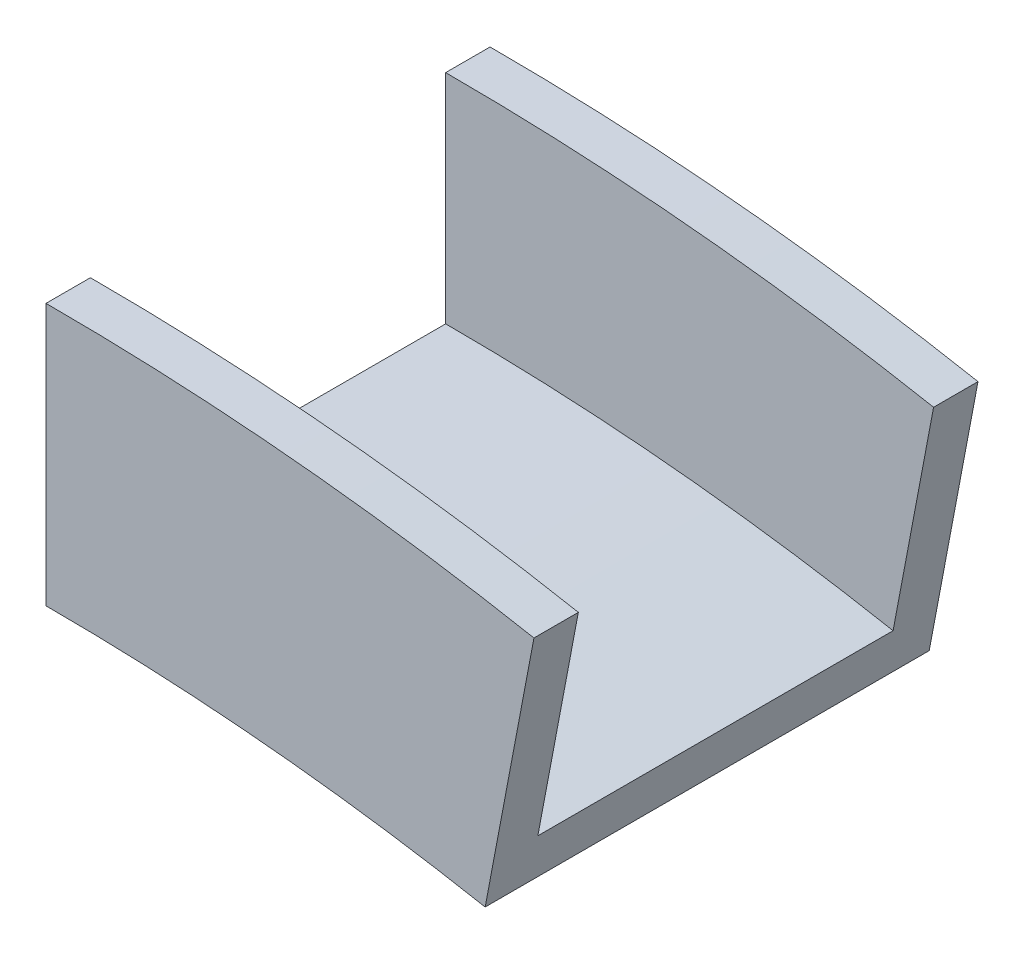
ISO-10303-21;
HEADER;
FILE_DESCRIPTION(('STEP AP214'),'2;1');
FILE_NAME('part.step','',(''),(''),'','','');
FILE_SCHEMA(('AUTOMOTIVE_DESIGN { 1 0 10303 214 1 1 1 1 }'));
ENDSEC;
DATA;
#1=APPLICATION_CONTEXT('core data for automotive mechanical design processes');
#2=APPLICATION_PROTOCOL_DEFINITION('international standard','automotive_design',2000,#1);
#3=PRODUCT_CONTEXT('',#1,'mechanical');
#4=PRODUCT('Part','Part','',(#3));
#5=PRODUCT_RELATED_PRODUCT_CATEGORY('part','',(#4));
#6=PRODUCT_DEFINITION_FORMATION('','',#4);
#7=PRODUCT_DEFINITION_CONTEXT('part definition',#1,'design');
#8=PRODUCT_DEFINITION('design','',#6,#7);
#9=PRODUCT_DEFINITION_SHAPE('','',#8);
#10=(LENGTH_UNIT() NAMED_UNIT(*) SI_UNIT(.MILLI.,.METRE.));
#11=(NAMED_UNIT(*) PLANE_ANGLE_UNIT() SI_UNIT($,.RADIAN.));
#12=(NAMED_UNIT(*) SI_UNIT($,.STERADIAN.) SOLID_ANGLE_UNIT());
#13=UNCERTAINTY_MEASURE_WITH_UNIT(LENGTH_MEASURE(1.E-05),#10,'distance_accuracy_value','');
#14=(GEOMETRIC_REPRESENTATION_CONTEXT(3) GLOBAL_UNCERTAINTY_ASSIGNED_CONTEXT((#13)) GLOBAL_UNIT_ASSIGNED_CONTEXT((#10,
#11,#12)) REPRESENTATION_CONTEXT('',''));
#15=CARTESIAN_POINT('',(0.,0.,0.));
#16=DIRECTION('',(0.,0.,1.));
#17=DIRECTION('',(1.,0.,0.));
#18=AXIS2_PLACEMENT_3D('',#15,#16,#17);
#19=CARTESIAN_POINT('',(0.,49.6794513874194,-0.01));
#20=DIRECTION('',(1.,0.,0.));
#21=DIRECTION('',(0.,1.,0.));
#22=AXIS2_PLACEMENT_3D('',#19,#20,#21);
#23=PLANE('',#22);
#24=DIRECTION('',(0.,0.,-1.));
#25=VECTOR('',#24,1.);
#26=CARTESIAN_POINT('',(0.,168.656,3.175));
#27=LINE('',#26,#25);
#28=CARTESIAN_POINT('',(0.,168.656,0.));
#29=VERTEX_POINT('',#28);
#30=CARTESIAN_POINT('',(0.,168.656,31.75));
#31=VERTEX_POINT('',#30);
#32=EDGE_CURVE('E141',#29,#31,#27,.F.);
#33=ORIENTED_EDGE('',*,*,#32,.T.);
#34=DIRECTION('',(0.,1.,0.));
#35=VECTOR('',#34,1.);
#36=CARTESIAN_POINT('',(0.,0.,31.75));
#37=LINE('',#36,#35);
#38=CARTESIAN_POINT('',(0.,187.3885,31.75));
#39=VERTEX_POINT('',#38);
#40=EDGE_CURVE('E37',#31,#39,#37,.T.);
#41=ORIENTED_EDGE('',*,*,#40,.T.);
#42=DIRECTION('',(0.,0.,-1.));
#43=VECTOR('',#42,1.);
#44=CARTESIAN_POINT('',(0.,187.3885,31.75));
#45=LINE('',#44,#43);
#46=CARTESIAN_POINT('',(0.,187.3885,28.575));
#47=VERTEX_POINT('',#46);
#48=EDGE_CURVE('E50',#47,#39,#45,.F.);
#49=ORIENTED_EDGE('',*,*,#48,.F.);
#50=DIRECTION('',(0.,1.,0.));
#51=VECTOR('',#50,1.);
#52=CARTESIAN_POINT('',(0.,0.,28.575));
#53=LINE('',#52,#51);
#54=CARTESIAN_POINT('',(0.,171.831,28.575));
#55=VERTEX_POINT('',#54);
#56=EDGE_CURVE('E58',#55,#47,#53,.T.);
#57=ORIENTED_EDGE('',*,*,#56,.F.);
#58=DIRECTION('',(0.,0.,-1.));
#59=VECTOR('',#58,1.);
#60=CARTESIAN_POINT('',(0.,171.831,28.575));
#61=LINE('',#60,#59);
#62=CARTESIAN_POINT('',(0.,171.831,3.175));
#63=VERTEX_POINT('',#62);
#64=EDGE_CURVE('E112',#63,#55,#61,.F.);
#65=ORIENTED_EDGE('',*,*,#64,.F.);
#66=DIRECTION('',(0.,1.,0.));
#67=VECTOR('',#66,1.);
#68=CARTESIAN_POINT('',(0.,0.,3.175));
#69=LINE('',#68,#67);
#70=CARTESIAN_POINT('',(0.,187.3885,3.175));
#71=VERTEX_POINT('',#70);
#72=EDGE_CURVE('E137',#63,#71,#69,.T.);
#73=ORIENTED_EDGE('',*,*,#72,.T.);
#74=DIRECTION('',(0.,0.,-1.));
#75=VECTOR('',#74,1.);
#76=CARTESIAN_POINT('',(0.,187.3885,3.175));
#77=LINE('',#76,#75);
#78=CARTESIAN_POINT('',(0.,187.3885,0.));
#79=VERTEX_POINT('',#78);
#80=EDGE_CURVE('E158',#79,#71,#77,.F.);
#81=ORIENTED_EDGE('',*,*,#80,.F.);
#82=DIRECTION('',(0.,1.,0.));
#83=VECTOR('',#82,1.);
#84=CARTESIAN_POINT('',(0.,0.,0.));
#85=LINE('',#84,#83);
#86=EDGE_CURVE('E156',#29,#79,#85,.T.);
#87=ORIENTED_EDGE('',*,*,#86,.F.);
#88=EDGE_LOOP('',(#33,#41,#49,#57,#65,#73,#81,#87));
#89=FACE_BOUND('',#88,.T.);
#90=ADVANCED_FACE('F33',(#89),#23,.F.);
#91=CARTESIAN_POINT('',(9.24937415001116,48.8108283886688,-0.01));
#92=DIRECTION('',(0.982515447041136,-0.186181084768449,0.));
#93=DIRECTION('',(0.186181084768449,0.982515447041136,0.));
#94=AXIS2_PLACEMENT_3D('',#91,#92,#93);
#95=PLANE('',#94);
#96=DIRECTION('',(0.,0.,-1.));
#97=VECTOR('',#96,1.);
#98=CARTESIAN_POINT('',(31.4005570327075,165.70712523617,3.175));
#99=LINE('',#98,#97);
#100=CARTESIAN_POINT('',(31.4005570327075,165.70712523617,0.));
#101=VERTEX_POINT('',#100);
#102=CARTESIAN_POINT('',(31.4005570327075,165.70712523617,31.75));
#103=VERTEX_POINT('',#102);
#104=EDGE_CURVE('E157',#101,#103,#99,.F.);
#105=ORIENTED_EDGE('',*,*,#104,.F.);
#106=DIRECTION('',(0.186181084768449,0.982515447041136,0.));
#107=VECTOR('',#106,1.);
#108=CARTESIAN_POINT('',(0.,0.,0.));
#109=LINE('',#108,#107);
#110=CARTESIAN_POINT('',(34.8881942031324,184.112095847868,0.));
#111=VERTEX_POINT('',#110);
#112=EDGE_CURVE('E140',#101,#111,#109,.T.);
#113=ORIENTED_EDGE('',*,*,#112,.T.);
#114=DIRECTION('',(0.,0.,-1.));
#115=VECTOR('',#114,1.);
#116=CARTESIAN_POINT('',(34.8881942031324,184.112095847868,3.175));
#117=LINE('',#116,#115);
#118=CARTESIAN_POINT('',(34.8881942031324,184.112095847868,3.175));
#119=VERTEX_POINT('',#118);
#120=EDGE_CURVE('E143',#111,#119,#117,.F.);
#121=ORIENTED_EDGE('',*,*,#120,.T.);
#122=DIRECTION('',(0.186181084768449,0.982515447041136,0.));
#123=VECTOR('',#122,1.);
#124=CARTESIAN_POINT('',(0.,0.,3.175));
#125=LINE('',#124,#123);
#126=CARTESIAN_POINT('',(31.9916819768473,168.826611780525,3.175));
#127=VERTEX_POINT('',#126);
#128=EDGE_CURVE('E139',#127,#119,#125,.T.);
#129=ORIENTED_EDGE('',*,*,#128,.F.);
#130=DIRECTION('',(0.,0.,-1.));
#131=VECTOR('',#130,1.);
#132=CARTESIAN_POINT('',(31.9916819768473,168.826611780525,28.575));
#133=LINE('',#132,#131);
#134=CARTESIAN_POINT('',(31.9916819768473,168.826611780526,28.575));
#135=VERTEX_POINT('',#134);
#136=EDGE_CURVE('E144',#127,#135,#133,.F.);
#137=ORIENTED_EDGE('',*,*,#136,.T.);
#138=DIRECTION('',(0.186181084768449,0.982515447041136,0.));
#139=VECTOR('',#138,1.);
#140=CARTESIAN_POINT('',(0.,0.,28.575));
#141=LINE('',#140,#139);
#142=CARTESIAN_POINT('',(34.8881942031324,184.112095847868,28.575));
#143=VERTEX_POINT('',#142);
#144=EDGE_CURVE('E118',#135,#143,#141,.T.);
#145=ORIENTED_EDGE('',*,*,#144,.T.);
#146=DIRECTION('',(0.,0.,-1.));
#147=VECTOR('',#146,1.);
#148=CARTESIAN_POINT('',(34.8881942031324,184.112095847868,31.75));
#149=LINE('',#148,#147);
#150=CARTESIAN_POINT('',(34.8881942031324,184.112095847868,31.75));
#151=VERTEX_POINT('',#150);
#152=EDGE_CURVE('E103',#143,#151,#149,.F.);
#153=ORIENTED_EDGE('',*,*,#152,.T.);
#154=DIRECTION('',(0.186181084768449,0.982515447041136,0.));
#155=VECTOR('',#154,1.);
#156=CARTESIAN_POINT('',(0.,0.,31.75));
#157=LINE('',#156,#155);
#158=EDGE_CURVE('E108',#103,#151,#157,.T.);
#159=ORIENTED_EDGE('',*,*,#158,.F.);
#160=EDGE_LOOP('',(#105,#113,#121,#129,#137,#145,#153,#159));
#161=FACE_BOUND('',#160,.T.);
#162=ADVANCED_FACE('F115',(#161),#95,.T.);
#163=CARTESIAN_POINT('',(0.,0.,3.175));
#164=DIRECTION('',(0.,0.,1.));
#165=DIRECTION('',(1.,0.,0.));
#166=AXIS2_PLACEMENT_3D('',#163,#164,#165);
#167=PLANE('',#166);
#168=ORIENTED_EDGE('',*,*,#72,.F.);
#169=CARTESIAN_POINT('',(0.,0.,3.175));
#170=DIRECTION('',(0.,0.,1.));
#171=DIRECTION('',(1.,0.,0.));
#172=AXIS2_PLACEMENT_3D('',#169,#170,#171);
#173=CIRCLE('',#172,171.831);
#174=EDGE_CURVE('E105',#127,#63,#173,.T.);
#175=ORIENTED_EDGE('',*,*,#174,.F.);
#176=ORIENTED_EDGE('',*,*,#128,.T.);
#177=CARTESIAN_POINT('',(0.,0.,3.175));
#178=DIRECTION('',(0.,0.,1.));
#179=DIRECTION('',(1.,0.,0.));
#180=AXIS2_PLACEMENT_3D('',#177,#178,#179);
#181=CIRCLE('',#180,187.3885);
#182=EDGE_CURVE('E134',#119,#71,#181,.T.);
#183=ORIENTED_EDGE('',*,*,#182,.T.);
#184=EDGE_LOOP('',(#168,#175,#176,#183));
#185=FACE_BOUND('',#184,.T.);
#186=ADVANCED_FACE('F190',(#185),#167,.T.);
#187=CARTESIAN_POINT('',(0.,0.,0.));
#188=DIRECTION('',(0.,0.,1.));
#189=DIRECTION('',(1.,0.,0.));
#190=AXIS2_PLACEMENT_3D('',#187,#188,#189);
#191=PLANE('',#190);
#192=CARTESIAN_POINT('',(0.,0.,0.));
#193=DIRECTION('',(0.,0.,1.));
#194=DIRECTION('',(1.,0.,0.));
#195=AXIS2_PLACEMENT_3D('',#192,#193,#194);
#196=CIRCLE('',#195,168.656);
#197=EDGE_CURVE('E128',#101,#29,#196,.T.);
#198=ORIENTED_EDGE('',*,*,#197,.T.);
#199=ORIENTED_EDGE('',*,*,#86,.T.);
#200=CARTESIAN_POINT('',(0.,0.,0.));
#201=DIRECTION('',(0.,0.,1.));
#202=DIRECTION('',(1.,0.,0.));
#203=AXIS2_PLACEMENT_3D('',#200,#201,#202);
#204=CIRCLE('',#203,187.3885);
#205=EDGE_CURVE('E131',#111,#79,#204,.T.);
#206=ORIENTED_EDGE('',*,*,#205,.F.);
#207=ORIENTED_EDGE('',*,*,#112,.F.);
#208=EDGE_LOOP('',(#198,#199,#206,#207));
#209=FACE_BOUND('',#208,.T.);
#210=ADVANCED_FACE('F166',(#209),#191,.F.);
#211=CARTESIAN_POINT('',(0.,0.,3.175));
#212=DIRECTION('',(0.,0.,-1.));
#213=DIRECTION('',(-1.,0.,0.));
#214=AXIS2_PLACEMENT_3D('',#211,#212,#213);
#215=CYLINDRICAL_SURFACE('',#214,187.3885);
#216=ORIENTED_EDGE('',*,*,#205,.T.);
#217=ORIENTED_EDGE('',*,*,#80,.T.);
#218=ORIENTED_EDGE('',*,*,#182,.F.);
#219=ORIENTED_EDGE('',*,*,#120,.F.);
#220=EDGE_LOOP('',(#216,#217,#218,#219));
#221=FACE_BOUND('',#220,.T.);
#222=ADVANCED_FACE('F172',(#221),#215,.T.);
#223=CARTESIAN_POINT('',(0.,0.,3.175));
#224=DIRECTION('',(0.,0.,-1.));
#225=DIRECTION('',(-1.,0.,0.));
#226=AXIS2_PLACEMENT_3D('',#223,#224,#225);
#227=CYLINDRICAL_SURFACE('',#226,168.656);
#228=ORIENTED_EDGE('',*,*,#32,.F.);
#229=ORIENTED_EDGE('',*,*,#197,.F.);
#230=ORIENTED_EDGE('',*,*,#104,.T.);
#231=CARTESIAN_POINT('',(0.,0.,31.75));
#232=DIRECTION('',(0.,0.,1.));
#233=DIRECTION('',(1.,0.,0.));
#234=AXIS2_PLACEMENT_3D('',#231,#232,#233);
#235=CIRCLE('',#234,168.656);
#236=EDGE_CURVE('E11',#103,#31,#235,.T.);
#237=ORIENTED_EDGE('',*,*,#236,.T.);
#238=EDGE_LOOP('',(#228,#229,#230,#237));
#239=FACE_BOUND('',#238,.T.);
#240=ADVANCED_FACE('F174',(#239),#227,.F.);
#241=CARTESIAN_POINT('',(0.,0.,28.575));
#242=DIRECTION('',(0.,0.,-1.));
#243=DIRECTION('',(-1.,0.,0.));
#244=AXIS2_PLACEMENT_3D('',#241,#242,#243);
#245=CYLINDRICAL_SURFACE('',#244,171.831);
#246=ORIENTED_EDGE('',*,*,#174,.T.);
#247=ORIENTED_EDGE('',*,*,#64,.T.);
#248=CARTESIAN_POINT('',(0.,0.,28.575));
#249=DIRECTION('',(0.,0.,1.));
#250=DIRECTION('',(1.,0.,0.));
#251=AXIS2_PLACEMENT_3D('',#248,#249,#250);
#252=CIRCLE('',#251,171.831);
#253=EDGE_CURVE('E126',#135,#55,#252,.T.);
#254=ORIENTED_EDGE('',*,*,#253,.F.);
#255=ORIENTED_EDGE('',*,*,#136,.F.);
#256=EDGE_LOOP('',(#246,#247,#254,#255));
#257=FACE_BOUND('',#256,.T.);
#258=ADVANCED_FACE('F176',(#257),#245,.T.);
#259=CARTESIAN_POINT('',(0.,0.,31.75));
#260=DIRECTION('',(0.,0.,1.));
#261=DIRECTION('',(1.,0.,0.));
#262=AXIS2_PLACEMENT_3D('',#259,#260,#261);
#263=PLANE('',#262);
#264=ORIENTED_EDGE('',*,*,#40,.F.);
#265=ORIENTED_EDGE('',*,*,#236,.F.);
#266=ORIENTED_EDGE('',*,*,#158,.T.);
#267=CARTESIAN_POINT('',(0.,0.,31.75));
#268=DIRECTION('',(0.,0.,1.));
#269=DIRECTION('',(1.,0.,0.));
#270=AXIS2_PLACEMENT_3D('',#267,#268,#269);
#271=CIRCLE('',#270,187.3885);
#272=EDGE_CURVE('E100',#151,#39,#271,.T.);
#273=ORIENTED_EDGE('',*,*,#272,.T.);
#274=EDGE_LOOP('',(#264,#265,#266,#273));
#275=FACE_BOUND('',#274,.T.);
#276=ADVANCED_FACE('F109',(#275),#263,.T.);
#277=CARTESIAN_POINT('',(0.,0.,28.575));
#278=DIRECTION('',(0.,0.,1.));
#279=DIRECTION('',(1.,0.,0.));
#280=AXIS2_PLACEMENT_3D('',#277,#278,#279);
#281=PLANE('',#280);
#282=ORIENTED_EDGE('',*,*,#253,.T.);
#283=ORIENTED_EDGE('',*,*,#56,.T.);
#284=CARTESIAN_POINT('',(0.,0.,28.575));
#285=DIRECTION('',(0.,0.,1.));
#286=DIRECTION('',(1.,0.,0.));
#287=AXIS2_PLACEMENT_3D('',#284,#285,#286);
#288=CIRCLE('',#287,187.3885);
#289=EDGE_CURVE('E42',#143,#47,#288,.T.);
#290=ORIENTED_EDGE('',*,*,#289,.F.);
#291=ORIENTED_EDGE('',*,*,#144,.F.);
#292=EDGE_LOOP('',(#282,#283,#290,#291));
#293=FACE_BOUND('',#292,.T.);
#294=ADVANCED_FACE('F233',(#293),#281,.F.);
#295=CARTESIAN_POINT('',(0.,0.,31.75));
#296=DIRECTION('',(0.,0.,-1.));
#297=DIRECTION('',(-1.,0.,0.));
#298=AXIS2_PLACEMENT_3D('',#295,#296,#297);
#299=CYLINDRICAL_SURFACE('',#298,187.3885);
#300=ORIENTED_EDGE('',*,*,#289,.T.);
#301=ORIENTED_EDGE('',*,*,#48,.T.);
#302=ORIENTED_EDGE('',*,*,#272,.F.);
#303=ORIENTED_EDGE('',*,*,#152,.F.);
#304=EDGE_LOOP('',(#300,#301,#302,#303));
#305=FACE_BOUND('',#304,.T.);
#306=ADVANCED_FACE('F35',(#305),#299,.T.);
#307=CLOSED_SHELL('',(#90,#162,#186,#210,#222,#240,#258,#276,#294,#306));
#308=MANIFOLD_SOLID_BREP('B2',#307);
#309=ADVANCED_BREP_SHAPE_REPRESENTATION('',(#18,#308),#14);
#310=SHAPE_DEFINITION_REPRESENTATION(#9,#309);
ENDSEC;
END-ISO-10303-21;
